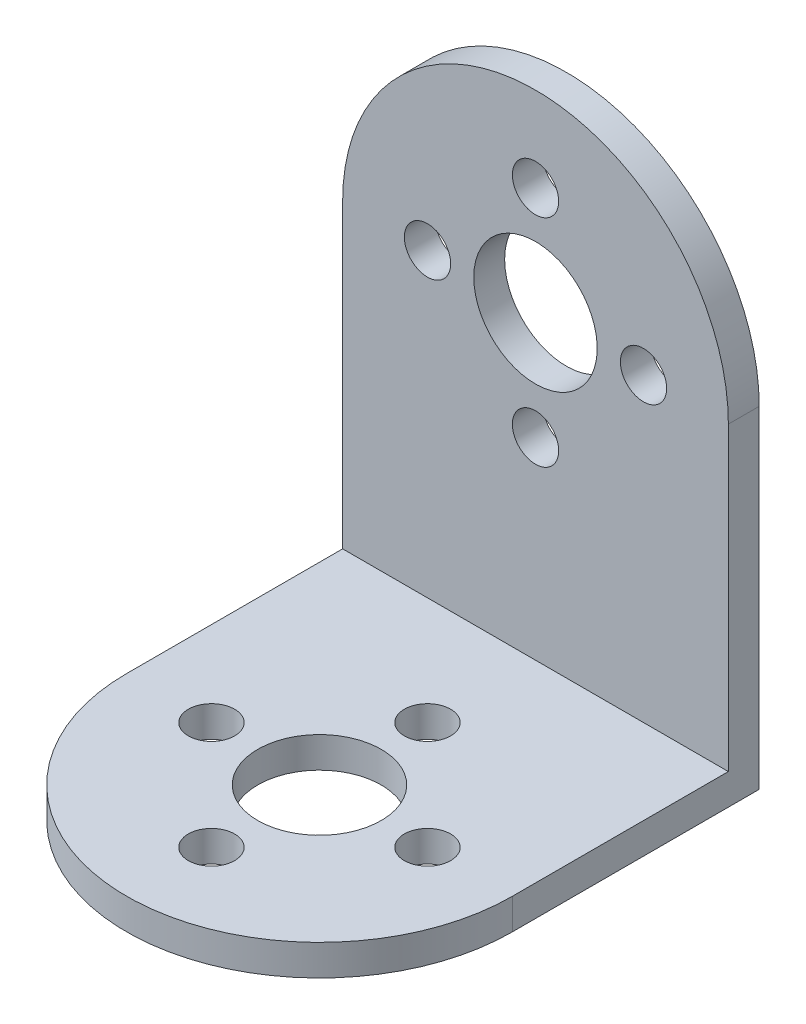
ISO-10303-21;
HEADER;
FILE_DESCRIPTION(('STEP AP214'),'2;1');
FILE_NAME('part.step','',(''),(''),'','','');
FILE_SCHEMA(('AUTOMOTIVE_DESIGN { 1 0 10303 214 1 1 1 1 }'));
ENDSEC;
DATA;
#1=APPLICATION_CONTEXT('core data for automotive mechanical design processes');
#2=APPLICATION_PROTOCOL_DEFINITION('international standard','automotive_design',2000,#1);
#3=PRODUCT_CONTEXT('',#1,'mechanical');
#4=PRODUCT('Part','Part','',(#3));
#5=PRODUCT_RELATED_PRODUCT_CATEGORY('part','',(#4));
#6=PRODUCT_DEFINITION_FORMATION('','',#4);
#7=PRODUCT_DEFINITION_CONTEXT('part definition',#1,'design');
#8=PRODUCT_DEFINITION('design','',#6,#7);
#9=PRODUCT_DEFINITION_SHAPE('','',#8);
#10=(LENGTH_UNIT() NAMED_UNIT(*) SI_UNIT(.MILLI.,.METRE.));
#11=(NAMED_UNIT(*) PLANE_ANGLE_UNIT() SI_UNIT($,.RADIAN.));
#12=(NAMED_UNIT(*) SI_UNIT($,.STERADIAN.) SOLID_ANGLE_UNIT());
#13=UNCERTAINTY_MEASURE_WITH_UNIT(LENGTH_MEASURE(1.E-05),#10,'distance_accuracy_value','');
#14=(GEOMETRIC_REPRESENTATION_CONTEXT(3) GLOBAL_UNCERTAINTY_ASSIGNED_CONTEXT((#13)) GLOBAL_UNIT_ASSIGNED_CONTEXT((#10,
#11,#12)) REPRESENTATION_CONTEXT('',''));
#15=CARTESIAN_POINT('',(0.,0.,0.));
#16=DIRECTION('',(0.,0.,1.));
#17=DIRECTION('',(1.,0.,0.));
#18=AXIS2_PLACEMENT_3D('',#15,#16,#17);
#19=CARTESIAN_POINT('',(0.,2.,7.));
#20=DIRECTION('',(0.,1.,0.));
#21=DIRECTION('',(0.,0.,1.));
#22=AXIS2_PLACEMENT_3D('',#19,#20,#21);
#23=PLANE('',#22);
#24=CARTESIAN_POINT('',(-7.,2.,7.));
#25=DIRECTION('',(0.,1.,0.));
#26=DIRECTION('',(0.,0.,1.));
#27=AXIS2_PLACEMENT_3D('',#24,#25,#26);
#28=CIRCLE('',#27,1.5);
#29=CARTESIAN_POINT('',(-7.,2.,8.5));
#30=VERTEX_POINT('',#29);
#31=EDGE_CURVE('E400',#30,#30,#28,.T.);
#32=ORIENTED_EDGE('',*,*,#31,.F.);
#33=EDGE_LOOP('',(#32));
#34=FACE_BOUND('',#33,.T.);
#35=CARTESIAN_POINT('',(0.,2.,0.));
#36=DIRECTION('',(0.,1.,0.));
#37=DIRECTION('',(0.,0.,1.));
#38=AXIS2_PLACEMENT_3D('',#35,#36,#37);
#39=CIRCLE('',#38,1.5);
#40=CARTESIAN_POINT('',(0.,2.,1.5));
#41=VERTEX_POINT('',#40);
#42=EDGE_CURVE('E410',#41,#41,#39,.T.);
#43=ORIENTED_EDGE('',*,*,#42,.F.);
#44=EDGE_LOOP('',(#43));
#45=FACE_BOUND('',#44,.T.);
#46=DIRECTION('',(0.,0.,1.));
#47=VECTOR('',#46,1.);
#48=CARTESIAN_POINT('',(-12.5,2.,7.));
#49=LINE('',#48,#47);
#50=CARTESIAN_POINT('',(-12.5,2.,-7.));
#51=VERTEX_POINT('',#50);
#52=CARTESIAN_POINT('',(-12.5,2.,7.));
#53=VERTEX_POINT('',#52);
#54=EDGE_CURVE('E91',#51,#53,#49,.T.);
#55=ORIENTED_EDGE('',*,*,#54,.T.);
#56=CARTESIAN_POINT('',(0.,2.,7.));
#57=DIRECTION('',(0.,1.,0.));
#58=DIRECTION('',(0.,0.,1.));
#59=AXIS2_PLACEMENT_3D('',#56,#57,#58);
#60=CIRCLE('',#59,12.5);
#61=CARTESIAN_POINT('',(12.5,2.,7.));
#62=VERTEX_POINT('',#61);
#63=EDGE_CURVE('E81',#53,#62,#60,.T.);
#64=ORIENTED_EDGE('',*,*,#63,.T.);
#65=DIRECTION('',(0.,0.,-1.));
#66=VECTOR('',#65,1.);
#67=CARTESIAN_POINT('',(12.5,2.,7.));
#68=LINE('',#67,#66);
#69=CARTESIAN_POINT('',(12.5,2.,-7.));
#70=VERTEX_POINT('',#69);
#71=EDGE_CURVE('E90',#62,#70,#68,.T.);
#72=ORIENTED_EDGE('',*,*,#71,.T.);
#73=DIRECTION('',(-1.,0.,0.));
#74=VECTOR('',#73,1.);
#75=CARTESIAN_POINT('',(12.5,2.,-7.));
#76=LINE('',#75,#74);
#77=EDGE_CURVE('E70',#70,#51,#76,.T.);
#78=ORIENTED_EDGE('',*,*,#77,.T.);
#79=EDGE_LOOP('',(#55,#64,#72,#78));
#80=FACE_BOUND('',#79,.T.);
#81=CARTESIAN_POINT('',(0.,2.,7.));
#82=DIRECTION('',(0.,1.,0.));
#83=DIRECTION('',(0.,0.,1.));
#84=AXIS2_PLACEMENT_3D('',#81,#82,#83);
#85=CIRCLE('',#84,4.);
#86=CARTESIAN_POINT('',(0.,2.,11.));
#87=VERTEX_POINT('',#86);
#88=EDGE_CURVE('E106',#87,#87,#85,.T.);
#89=ORIENTED_EDGE('',*,*,#88,.F.);
#90=EDGE_LOOP('',(#89));
#91=FACE_BOUND('',#90,.T.);
#92=CARTESIAN_POINT('',(7.,2.,7.));
#93=DIRECTION('',(0.,1.,0.));
#94=DIRECTION('',(0.,0.,1.));
#95=AXIS2_PLACEMENT_3D('',#92,#93,#94);
#96=CIRCLE('',#95,1.5);
#97=CARTESIAN_POINT('',(7.,2.,8.5));
#98=VERTEX_POINT('',#97);
#99=EDGE_CURVE('E405',#98,#98,#96,.T.);
#100=ORIENTED_EDGE('',*,*,#99,.F.);
#101=EDGE_LOOP('',(#100));
#102=FACE_BOUND('',#101,.T.);
#103=CARTESIAN_POINT('',(0.,2.,14.));
#104=DIRECTION('',(0.,1.,0.));
#105=DIRECTION('',(0.,0.,1.));
#106=AXIS2_PLACEMENT_3D('',#103,#104,#105);
#107=CIRCLE('',#106,1.5);
#108=CARTESIAN_POINT('',(0.,2.,15.5));
#109=VERTEX_POINT('',#108);
#110=EDGE_CURVE('E395',#109,#109,#107,.T.);
#111=ORIENTED_EDGE('',*,*,#110,.F.);
#112=EDGE_LOOP('',(#111));
#113=FACE_BOUND('',#112,.T.);
#114=ADVANCED_FACE('F34',(#34,#45,#80,#91,#102,#113),#23,.T.);
#115=CARTESIAN_POINT('',(0.,0.,7.));
#116=DIRECTION('',(0.,1.,0.));
#117=DIRECTION('',(0.,0.,1.));
#118=AXIS2_PLACEMENT_3D('',#115,#116,#117);
#119=PLANE('',#118);
#120=CARTESIAN_POINT('',(-7.,0.,7.));
#121=DIRECTION('',(0.,1.,0.));
#122=DIRECTION('',(0.,0.,1.));
#123=AXIS2_PLACEMENT_3D('',#120,#121,#122);
#124=CIRCLE('',#123,1.5);
#125=CARTESIAN_POINT('',(-7.,0.,8.5));
#126=VERTEX_POINT('',#125);
#127=EDGE_CURVE('E398',#126,#126,#124,.T.);
#128=ORIENTED_EDGE('',*,*,#127,.T.);
#129=EDGE_LOOP('',(#128));
#130=FACE_BOUND('',#129,.T.);
#131=CARTESIAN_POINT('',(0.,0.,0.));
#132=DIRECTION('',(0.,1.,0.));
#133=DIRECTION('',(0.,0.,1.));
#134=AXIS2_PLACEMENT_3D('',#131,#132,#133);
#135=CIRCLE('',#134,1.5);
#136=CARTESIAN_POINT('',(0.,0.,1.5));
#137=VERTEX_POINT('',#136);
#138=EDGE_CURVE('E408',#137,#137,#135,.T.);
#139=ORIENTED_EDGE('',*,*,#138,.T.);
#140=EDGE_LOOP('',(#139));
#141=FACE_BOUND('',#140,.T.);
#142=DIRECTION('',(0.,0.,1.));
#143=VECTOR('',#142,1.);
#144=CARTESIAN_POINT('',(-12.5,0.,7.));
#145=LINE('',#144,#143);
#146=CARTESIAN_POINT('',(-12.5,0.,-9.));
#147=VERTEX_POINT('',#146);
#148=CARTESIAN_POINT('',(-12.5,0.,7.));
#149=VERTEX_POINT('',#148);
#150=EDGE_CURVE('E99',#147,#149,#145,.T.);
#151=ORIENTED_EDGE('',*,*,#150,.F.);
#152=DIRECTION('',(-1.,0.,0.));
#153=VECTOR('',#152,1.);
#154=CARTESIAN_POINT('',(12.5,0.,-9.));
#155=LINE('',#154,#153);
#156=CARTESIAN_POINT('',(12.5,0.,-9.));
#157=VERTEX_POINT('',#156);
#158=EDGE_CURVE('E153',#157,#147,#155,.T.);
#159=ORIENTED_EDGE('',*,*,#158,.F.);
#160=DIRECTION('',(0.,0.,-1.));
#161=VECTOR('',#160,1.);
#162=CARTESIAN_POINT('',(12.5,0.,7.));
#163=LINE('',#162,#161);
#164=CARTESIAN_POINT('',(12.5,0.,7.));
#165=VERTEX_POINT('',#164);
#166=EDGE_CURVE('E96',#165,#157,#163,.T.);
#167=ORIENTED_EDGE('',*,*,#166,.F.);
#168=CARTESIAN_POINT('',(0.,0.,7.));
#169=DIRECTION('',(0.,1.,0.));
#170=DIRECTION('',(0.,0.,1.));
#171=AXIS2_PLACEMENT_3D('',#168,#169,#170);
#172=CIRCLE('',#171,12.5);
#173=EDGE_CURVE('E66',#149,#165,#172,.T.);
#174=ORIENTED_EDGE('',*,*,#173,.F.);
#175=EDGE_LOOP('',(#151,#159,#167,#174));
#176=FACE_BOUND('',#175,.T.);
#177=CARTESIAN_POINT('',(0.,0.,7.));
#178=DIRECTION('',(0.,1.,0.));
#179=DIRECTION('',(0.,0.,1.));
#180=AXIS2_PLACEMENT_3D('',#177,#178,#179);
#181=CIRCLE('',#180,4.);
#182=CARTESIAN_POINT('',(0.,0.,11.));
#183=VERTEX_POINT('',#182);
#184=EDGE_CURVE('E110',#183,#183,#181,.T.);
#185=ORIENTED_EDGE('',*,*,#184,.T.);
#186=EDGE_LOOP('',(#185));
#187=FACE_BOUND('',#186,.T.);
#188=CARTESIAN_POINT('',(7.,0.,7.));
#189=DIRECTION('',(0.,1.,0.));
#190=DIRECTION('',(0.,0.,1.));
#191=AXIS2_PLACEMENT_3D('',#188,#189,#190);
#192=CIRCLE('',#191,1.5);
#193=CARTESIAN_POINT('',(7.,0.,8.5));
#194=VERTEX_POINT('',#193);
#195=EDGE_CURVE('E391',#194,#194,#192,.T.);
#196=ORIENTED_EDGE('',*,*,#195,.T.);
#197=EDGE_LOOP('',(#196));
#198=FACE_BOUND('',#197,.T.);
#199=CARTESIAN_POINT('',(0.,0.,14.));
#200=DIRECTION('',(0.,1.,0.));
#201=DIRECTION('',(0.,0.,1.));
#202=AXIS2_PLACEMENT_3D('',#199,#200,#201);
#203=CIRCLE('',#202,1.5);
#204=CARTESIAN_POINT('',(0.,0.,15.5));
#205=VERTEX_POINT('',#204);
#206=EDGE_CURVE('E149',#205,#205,#203,.T.);
#207=ORIENTED_EDGE('',*,*,#206,.T.);
#208=EDGE_LOOP('',(#207));
#209=FACE_BOUND('',#208,.T.);
#210=ADVANCED_FACE('F207',(#130,#141,#176,#187,#198,#209),#119,.F.);
#211=CARTESIAN_POINT('',(-12.5,2.,7.));
#212=DIRECTION('',(1.,0.,0.));
#213=DIRECTION('',(0.,0.,-1.));
#214=AXIS2_PLACEMENT_3D('',#211,#212,#213);
#215=PLANE('',#214);
#216=ORIENTED_EDGE('',*,*,#150,.T.);
#217=DIRECTION('',(0.,-1.,0.));
#218=VECTOR('',#217,1.);
#219=CARTESIAN_POINT('',(-12.5,2.,7.));
#220=LINE('',#219,#218);
#221=EDGE_CURVE('E11',#53,#149,#220,.T.);
#222=ORIENTED_EDGE('',*,*,#221,.F.);
#223=ORIENTED_EDGE('',*,*,#54,.F.);
#224=DIRECTION('',(0.,1.,0.));
#225=VECTOR('',#224,1.);
#226=CARTESIAN_POINT('',(-12.5,0.,-7.));
#227=LINE('',#226,#225);
#228=CARTESIAN_POINT('',(-12.5,21.5,-7.));
#229=VERTEX_POINT('',#228);
#230=EDGE_CURVE('E53',#51,#229,#227,.T.);
#231=ORIENTED_EDGE('',*,*,#230,.T.);
#232=DIRECTION('',(0.,0.,1.));
#233=VECTOR('',#232,1.);
#234=CARTESIAN_POINT('',(-12.5,21.5,-9.));
#235=LINE('',#234,#233);
#236=CARTESIAN_POINT('',(-12.5,21.5,-9.));
#237=VERTEX_POINT('',#236);
#238=EDGE_CURVE('E136',#237,#229,#235,.T.);
#239=ORIENTED_EDGE('',*,*,#238,.F.);
#240=DIRECTION('',(0.,1.,0.));
#241=VECTOR('',#240,1.);
#242=CARTESIAN_POINT('',(-12.5,0.,-9.));
#243=LINE('',#242,#241);
#244=EDGE_CURVE('E103',#147,#237,#243,.T.);
#245=ORIENTED_EDGE('',*,*,#244,.F.);
#246=EDGE_LOOP('',(#216,#222,#223,#231,#239,#245));
#247=FACE_BOUND('',#246,.T.);
#248=ADVANCED_FACE('F36',(#247),#215,.F.);
#249=CARTESIAN_POINT('',(0.,2.,7.));
#250=DIRECTION('',(0.,-1.,0.));
#251=DIRECTION('',(0.,0.,-1.));
#252=AXIS2_PLACEMENT_3D('',#249,#250,#251);
#253=CYLINDRICAL_SURFACE('',#252,12.5);
#254=ORIENTED_EDGE('',*,*,#173,.T.);
#255=DIRECTION('',(0.,-1.,0.));
#256=VECTOR('',#255,1.);
#257=CARTESIAN_POINT('',(12.5,2.,7.));
#258=LINE('',#257,#256);
#259=EDGE_CURVE('E44',#62,#165,#258,.T.);
#260=ORIENTED_EDGE('',*,*,#259,.F.);
#261=ORIENTED_EDGE('',*,*,#63,.F.);
#262=ORIENTED_EDGE('',*,*,#221,.T.);
#263=EDGE_LOOP('',(#254,#260,#261,#262));
#264=FACE_BOUND('',#263,.T.);
#265=ADVANCED_FACE('F83',(#264),#253,.T.);
#266=CARTESIAN_POINT('',(12.5,2.,7.));
#267=DIRECTION('',(-1.,0.,0.));
#268=DIRECTION('',(0.,0.,1.));
#269=AXIS2_PLACEMENT_3D('',#266,#267,#268);
#270=PLANE('',#269);
#271=ORIENTED_EDGE('',*,*,#166,.T.);
#272=DIRECTION('',(0.,-1.,0.));
#273=VECTOR('',#272,1.);
#274=CARTESIAN_POINT('',(12.5,0.,-9.));
#275=LINE('',#274,#273);
#276=CARTESIAN_POINT('',(12.5,21.5,-9.));
#277=VERTEX_POINT('',#276);
#278=EDGE_CURVE('E147',#277,#157,#275,.T.);
#279=ORIENTED_EDGE('',*,*,#278,.F.);
#280=DIRECTION('',(0.,0.,1.));
#281=VECTOR('',#280,1.);
#282=CARTESIAN_POINT('',(12.5,21.5,-9.));
#283=LINE('',#282,#281);
#284=CARTESIAN_POINT('',(12.5,21.5,-7.));
#285=VERTEX_POINT('',#284);
#286=EDGE_CURVE('E126',#277,#285,#283,.T.);
#287=ORIENTED_EDGE('',*,*,#286,.T.);
#288=DIRECTION('',(0.,-1.,0.));
#289=VECTOR('',#288,1.);
#290=CARTESIAN_POINT('',(12.5,0.,-7.));
#291=LINE('',#290,#289);
#292=EDGE_CURVE('E123',#285,#70,#291,.T.);
#293=ORIENTED_EDGE('',*,*,#292,.T.);
#294=ORIENTED_EDGE('',*,*,#71,.F.);
#295=ORIENTED_EDGE('',*,*,#259,.T.);
#296=EDGE_LOOP('',(#271,#279,#287,#293,#294,#295));
#297=FACE_BOUND('',#296,.T.);
#298=ADVANCED_FACE('F121',(#297),#270,.F.);
#299=CARTESIAN_POINT('',(0.,2.,7.));
#300=DIRECTION('',(0.,-1.,0.));
#301=DIRECTION('',(0.,0.,-1.));
#302=AXIS2_PLACEMENT_3D('',#299,#300,#301);
#303=CYLINDRICAL_SURFACE('',#302,4.);
#304=ORIENTED_EDGE('',*,*,#88,.T.);
#305=EDGE_LOOP('',(#304));
#306=FACE_BOUND('',#305,.T.);
#307=ORIENTED_EDGE('',*,*,#184,.F.);
#308=EDGE_LOOP('',(#307));
#309=FACE_BOUND('',#308,.T.);
#310=ADVANCED_FACE('F218',(#306,#309),#303,.F.);
#311=CARTESIAN_POINT('',(0.,2.,0.));
#312=DIRECTION('',(0.,-1.,0.));
#313=DIRECTION('',(0.,0.,-1.));
#314=AXIS2_PLACEMENT_3D('',#311,#312,#313);
#315=CYLINDRICAL_SURFACE('',#314,1.5);
#316=ORIENTED_EDGE('',*,*,#42,.T.);
#317=EDGE_LOOP('',(#316));
#318=FACE_BOUND('',#317,.T.);
#319=ORIENTED_EDGE('',*,*,#138,.F.);
#320=EDGE_LOOP('',(#319));
#321=FACE_BOUND('',#320,.T.);
#322=ADVANCED_FACE('F267',(#318,#321),#315,.F.);
#323=CARTESIAN_POINT('',(7.,2.,7.));
#324=DIRECTION('',(0.,-1.,0.));
#325=DIRECTION('',(0.,0.,-1.));
#326=AXIS2_PLACEMENT_3D('',#323,#324,#325);
#327=CYLINDRICAL_SURFACE('',#326,1.5);
#328=ORIENTED_EDGE('',*,*,#99,.T.);
#329=EDGE_LOOP('',(#328));
#330=FACE_BOUND('',#329,.T.);
#331=ORIENTED_EDGE('',*,*,#195,.F.);
#332=EDGE_LOOP('',(#331));
#333=FACE_BOUND('',#332,.T.);
#334=ADVANCED_FACE('F257',(#330,#333),#327,.F.);
#335=CARTESIAN_POINT('',(-7.,2.,7.));
#336=DIRECTION('',(0.,-1.,0.));
#337=DIRECTION('',(0.,0.,-1.));
#338=AXIS2_PLACEMENT_3D('',#335,#336,#337);
#339=CYLINDRICAL_SURFACE('',#338,1.5);
#340=ORIENTED_EDGE('',*,*,#31,.T.);
#341=EDGE_LOOP('',(#340));
#342=FACE_BOUND('',#341,.T.);
#343=ORIENTED_EDGE('',*,*,#127,.F.);
#344=EDGE_LOOP('',(#343));
#345=FACE_BOUND('',#344,.T.);
#346=ADVANCED_FACE('F247',(#342,#345),#339,.F.);
#347=CARTESIAN_POINT('',(0.,2.,14.));
#348=DIRECTION('',(0.,-1.,0.));
#349=DIRECTION('',(0.,0.,-1.));
#350=AXIS2_PLACEMENT_3D('',#347,#348,#349);
#351=CYLINDRICAL_SURFACE('',#350,1.5);
#352=ORIENTED_EDGE('',*,*,#110,.T.);
#353=EDGE_LOOP('',(#352));
#354=FACE_BOUND('',#353,.T.);
#355=ORIENTED_EDGE('',*,*,#206,.F.);
#356=EDGE_LOOP('',(#355));
#357=FACE_BOUND('',#356,.T.);
#358=ADVANCED_FACE('F200',(#354,#357),#351,.F.);
#359=CARTESIAN_POINT('',(0.,21.5,-7.));
#360=DIRECTION('',(0.,0.,1.));
#361=DIRECTION('',(1.,0.,0.));
#362=AXIS2_PLACEMENT_3D('',#359,#360,#361);
#363=PLANE('',#362);
#364=CARTESIAN_POINT('',(7.,21.5,-7.));
#365=DIRECTION('',(0.,0.,-1.));
#366=DIRECTION('',(-1.,0.,0.));
#367=AXIS2_PLACEMENT_3D('',#364,#365,#366);
#368=CIRCLE('',#367,1.5);
#369=CARTESIAN_POINT('',(5.5,21.5,-7.));
#370=VERTEX_POINT('',#369);
#371=EDGE_CURVE('E178',#370,#370,#368,.T.);
#372=ORIENTED_EDGE('',*,*,#371,.T.);
#373=EDGE_LOOP('',(#372));
#374=FACE_BOUND('',#373,.T.);
#375=CARTESIAN_POINT('',(-7.,21.5,-7.));
#376=DIRECTION('',(0.,0.,-1.));
#377=DIRECTION('',(-1.,0.,0.));
#378=AXIS2_PLACEMENT_3D('',#375,#376,#377);
#379=CIRCLE('',#378,1.5);
#380=CARTESIAN_POINT('',(-8.5,21.5,-7.));
#381=VERTEX_POINT('',#380);
#382=EDGE_CURVE('E166',#381,#381,#379,.T.);
#383=ORIENTED_EDGE('',*,*,#382,.T.);
#384=EDGE_LOOP('',(#383));
#385=FACE_BOUND('',#384,.T.);
#386=CARTESIAN_POINT('',(0.,21.5,-7.));
#387=DIRECTION('',(0.,0.,-1.));
#388=DIRECTION('',(-1.,0.,0.));
#389=AXIS2_PLACEMENT_3D('',#386,#387,#388);
#390=CIRCLE('',#389,4.);
#391=CARTESIAN_POINT('',(-4.,21.5,-7.));
#392=VERTEX_POINT('',#391);
#393=EDGE_CURVE('E132',#392,#392,#390,.T.);
#394=ORIENTED_EDGE('',*,*,#393,.T.);
#395=EDGE_LOOP('',(#394));
#396=FACE_BOUND('',#395,.T.);
#397=CARTESIAN_POINT('',(0.,28.5,-7.));
#398=DIRECTION('',(0.,0.,-1.));
#399=DIRECTION('',(-1.,0.,0.));
#400=AXIS2_PLACEMENT_3D('',#397,#398,#399);
#401=CIRCLE('',#400,1.5);
#402=CARTESIAN_POINT('',(-1.5,28.5,-7.));
#403=VERTEX_POINT('',#402);
#404=EDGE_CURVE('E160',#403,#403,#401,.T.);
#405=ORIENTED_EDGE('',*,*,#404,.T.);
#406=EDGE_LOOP('',(#405));
#407=FACE_BOUND('',#406,.T.);
#408=CARTESIAN_POINT('',(0.,14.5,-7.));
#409=DIRECTION('',(0.,0.,-1.));
#410=DIRECTION('',(-1.,0.,0.));
#411=AXIS2_PLACEMENT_3D('',#408,#409,#410);
#412=CIRCLE('',#411,1.5);
#413=CARTESIAN_POINT('',(-1.5,14.5,-7.));
#414=VERTEX_POINT('',#413);
#415=EDGE_CURVE('E172',#414,#414,#412,.T.);
#416=ORIENTED_EDGE('',*,*,#415,.T.);
#417=EDGE_LOOP('',(#416));
#418=FACE_BOUND('',#417,.T.);
#419=ORIENTED_EDGE('',*,*,#77,.F.);
#420=ORIENTED_EDGE('',*,*,#292,.F.);
#421=CARTESIAN_POINT('',(0.,21.5,-7.));
#422=DIRECTION('',(0.,0.,-1.));
#423=DIRECTION('',(1.,0.,0.));
#424=AXIS2_PLACEMENT_3D('',#421,#422,#423);
#425=CIRCLE('',#424,12.5);
#426=EDGE_CURVE('E129',#229,#285,#425,.T.);
#427=ORIENTED_EDGE('',*,*,#426,.F.);
#428=ORIENTED_EDGE('',*,*,#230,.F.);
#429=EDGE_LOOP('',(#419,#420,#427,#428));
#430=FACE_BOUND('',#429,.T.);
#431=ADVANCED_FACE('F190',(#374,#385,#396,#407,#418,#430),#363,.T.);
#432=CARTESIAN_POINT('',(0.,21.5,-9.));
#433=DIRECTION('',(0.,0.,1.));
#434=DIRECTION('',(1.,0.,0.));
#435=AXIS2_PLACEMENT_3D('',#432,#433,#434);
#436=PLANE('',#435);
#437=CARTESIAN_POINT('',(0.,14.5,-9.));
#438=DIRECTION('',(0.,0.,-1.));
#439=DIRECTION('',(-1.,0.,0.));
#440=AXIS2_PLACEMENT_3D('',#437,#438,#439);
#441=CIRCLE('',#440,1.5);
#442=CARTESIAN_POINT('',(-1.5,14.5,-9.));
#443=VERTEX_POINT('',#442);
#444=EDGE_CURVE('E169',#443,#443,#441,.T.);
#445=ORIENTED_EDGE('',*,*,#444,.F.);
#446=EDGE_LOOP('',(#445));
#447=FACE_BOUND('',#446,.T.);
#448=CARTESIAN_POINT('',(0.,28.5,-9.));
#449=DIRECTION('',(0.,0.,-1.));
#450=DIRECTION('',(-1.,0.,0.));
#451=AXIS2_PLACEMENT_3D('',#448,#449,#450);
#452=CIRCLE('',#451,1.5);
#453=CARTESIAN_POINT('',(-1.5,28.5,-9.));
#454=VERTEX_POINT('',#453);
#455=EDGE_CURVE('E158',#454,#454,#452,.T.);
#456=ORIENTED_EDGE('',*,*,#455,.F.);
#457=EDGE_LOOP('',(#456));
#458=FACE_BOUND('',#457,.T.);
#459=ORIENTED_EDGE('',*,*,#278,.T.);
#460=ORIENTED_EDGE('',*,*,#158,.T.);
#461=ORIENTED_EDGE('',*,*,#244,.T.);
#462=CARTESIAN_POINT('',(0.,21.5,-9.));
#463=DIRECTION('',(0.,0.,-1.));
#464=DIRECTION('',(1.,0.,0.));
#465=AXIS2_PLACEMENT_3D('',#462,#463,#464);
#466=CIRCLE('',#465,12.5);
#467=EDGE_CURVE('E142',#237,#277,#466,.T.);
#468=ORIENTED_EDGE('',*,*,#467,.T.);
#469=EDGE_LOOP('',(#459,#460,#461,#468));
#470=FACE_BOUND('',#469,.T.);
#471=CARTESIAN_POINT('',(0.,21.5,-9.));
#472=DIRECTION('',(0.,0.,-1.));
#473=DIRECTION('',(-1.,0.,0.));
#474=AXIS2_PLACEMENT_3D('',#471,#472,#473);
#475=CIRCLE('',#474,4.);
#476=CARTESIAN_POINT('',(-4.,21.5,-9.));
#477=VERTEX_POINT('',#476);
#478=EDGE_CURVE('E127',#477,#477,#475,.T.);
#479=ORIENTED_EDGE('',*,*,#478,.F.);
#480=EDGE_LOOP('',(#479));
#481=FACE_BOUND('',#480,.T.);
#482=CARTESIAN_POINT('',(-7.,21.5,-9.));
#483=DIRECTION('',(0.,0.,-1.));
#484=DIRECTION('',(-1.,0.,0.));
#485=AXIS2_PLACEMENT_3D('',#482,#483,#484);
#486=CIRCLE('',#485,1.5);
#487=CARTESIAN_POINT('',(-8.5,21.5,-9.));
#488=VERTEX_POINT('',#487);
#489=EDGE_CURVE('E163',#488,#488,#486,.T.);
#490=ORIENTED_EDGE('',*,*,#489,.F.);
#491=EDGE_LOOP('',(#490));
#492=FACE_BOUND('',#491,.T.);
#493=CARTESIAN_POINT('',(7.,21.5,-9.));
#494=DIRECTION('',(0.,0.,-1.));
#495=DIRECTION('',(-1.,0.,0.));
#496=AXIS2_PLACEMENT_3D('',#493,#494,#495);
#497=CIRCLE('',#496,1.5);
#498=CARTESIAN_POINT('',(5.5,21.5,-9.));
#499=VERTEX_POINT('',#498);
#500=EDGE_CURVE('E175',#499,#499,#497,.T.);
#501=ORIENTED_EDGE('',*,*,#500,.F.);
#502=EDGE_LOOP('',(#501));
#503=FACE_BOUND('',#502,.T.);
#504=ADVANCED_FACE('F187',(#447,#458,#470,#481,#492,#503),#436,.F.);
#505=CARTESIAN_POINT('',(0.,21.5,-9.));
#506=DIRECTION('',(0.,0.,1.));
#507=DIRECTION('',(1.,0.,0.));
#508=AXIS2_PLACEMENT_3D('',#505,#506,#507);
#509=CYLINDRICAL_SURFACE('',#508,12.5);
#510=ORIENTED_EDGE('',*,*,#426,.T.);
#511=ORIENTED_EDGE('',*,*,#286,.F.);
#512=ORIENTED_EDGE('',*,*,#467,.F.);
#513=ORIENTED_EDGE('',*,*,#238,.T.);
#514=EDGE_LOOP('',(#510,#511,#512,#513));
#515=FACE_BOUND('',#514,.T.);
#516=ADVANCED_FACE('F189',(#515),#509,.T.);
#517=CARTESIAN_POINT('',(0.,21.5,-9.));
#518=DIRECTION('',(0.,0.,1.));
#519=DIRECTION('',(1.,0.,0.));
#520=AXIS2_PLACEMENT_3D('',#517,#518,#519);
#521=CYLINDRICAL_SURFACE('',#520,4.);
#522=ORIENTED_EDGE('',*,*,#478,.T.);
#523=EDGE_LOOP('',(#522));
#524=FACE_BOUND('',#523,.T.);
#525=ORIENTED_EDGE('',*,*,#393,.F.);
#526=EDGE_LOOP('',(#525));
#527=FACE_BOUND('',#526,.T.);
#528=ADVANCED_FACE('F197',(#524,#527),#521,.F.);
#529=CARTESIAN_POINT('',(0.,28.5,-9.));
#530=DIRECTION('',(0.,0.,1.));
#531=DIRECTION('',(1.,0.,0.));
#532=AXIS2_PLACEMENT_3D('',#529,#530,#531);
#533=CYLINDRICAL_SURFACE('',#532,1.5);
#534=ORIENTED_EDGE('',*,*,#455,.T.);
#535=EDGE_LOOP('',(#534));
#536=FACE_BOUND('',#535,.T.);
#537=ORIENTED_EDGE('',*,*,#404,.F.);
#538=EDGE_LOOP('',(#537));
#539=FACE_BOUND('',#538,.T.);
#540=ADVANCED_FACE('F324',(#536,#539),#533,.F.);
#541=CARTESIAN_POINT('',(-7.,21.5,-9.));
#542=DIRECTION('',(0.,0.,1.));
#543=DIRECTION('',(1.,0.,0.));
#544=AXIS2_PLACEMENT_3D('',#541,#542,#543);
#545=CYLINDRICAL_SURFACE('',#544,1.5);
#546=ORIENTED_EDGE('',*,*,#489,.T.);
#547=EDGE_LOOP('',(#546));
#548=FACE_BOUND('',#547,.T.);
#549=ORIENTED_EDGE('',*,*,#382,.F.);
#550=EDGE_LOOP('',(#549));
#551=FACE_BOUND('',#550,.T.);
#552=ADVANCED_FACE('F332',(#548,#551),#545,.F.);
#553=CARTESIAN_POINT('',(0.,14.5,-9.));
#554=DIRECTION('',(0.,0.,1.));
#555=DIRECTION('',(1.,0.,0.));
#556=AXIS2_PLACEMENT_3D('',#553,#554,#555);
#557=CYLINDRICAL_SURFACE('',#556,1.5);
#558=ORIENTED_EDGE('',*,*,#444,.T.);
#559=EDGE_LOOP('',(#558));
#560=FACE_BOUND('',#559,.T.);
#561=ORIENTED_EDGE('',*,*,#415,.F.);
#562=EDGE_LOOP('',(#561));
#563=FACE_BOUND('',#562,.T.);
#564=ADVANCED_FACE('F341',(#560,#563),#557,.F.);
#565=CARTESIAN_POINT('',(7.,21.5,-9.));
#566=DIRECTION('',(0.,0.,1.));
#567=DIRECTION('',(1.,0.,0.));
#568=AXIS2_PLACEMENT_3D('',#565,#566,#567);
#569=CYLINDRICAL_SURFACE('',#568,1.5);
#570=ORIENTED_EDGE('',*,*,#500,.T.);
#571=EDGE_LOOP('',(#570));
#572=FACE_BOUND('',#571,.T.);
#573=ORIENTED_EDGE('',*,*,#371,.F.);
#574=EDGE_LOOP('',(#573));
#575=FACE_BOUND('',#574,.T.);
#576=ADVANCED_FACE('F184',(#572,#575),#569,.F.);
#577=CLOSED_SHELL('',(#114,#210,#248,#265,#298,#310,#322,#334,#346,#358,#431,#504,#516,#528,
#540,#552,#564,#576));
#578=MANIFOLD_SOLID_BREP('B2',#577);
#579=ADVANCED_BREP_SHAPE_REPRESENTATION('',(#18,#578),#14);
#580=SHAPE_DEFINITION_REPRESENTATION(#9,#579);
ENDSEC;
END-ISO-10303-21;
